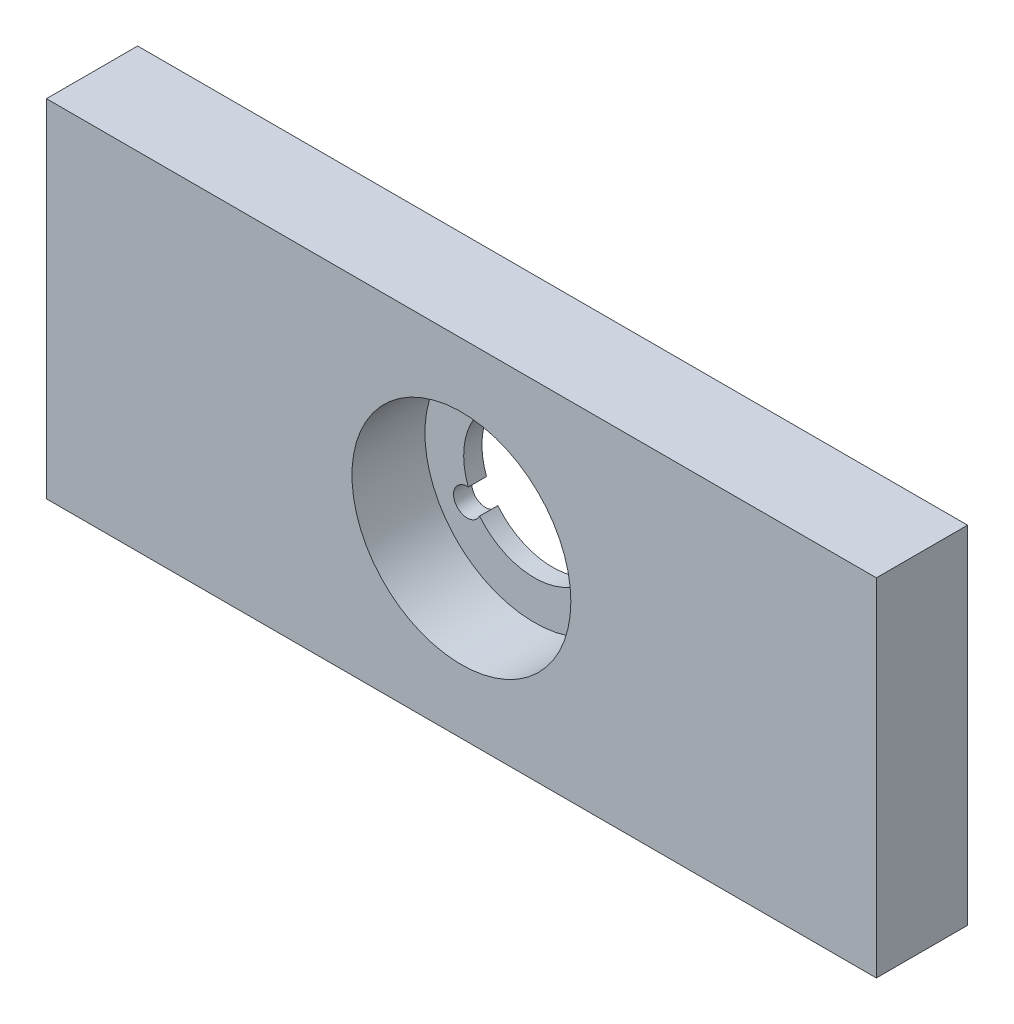
ISO-10303-21;
HEADER;
FILE_DESCRIPTION(('STEP AP214'),'2;1');
FILE_NAME('part.step','',(''),(''),'','','');
FILE_SCHEMA(('AUTOMOTIVE_DESIGN { 1 0 10303 214 1 1 1 1 }'));
ENDSEC;
DATA;
#1=APPLICATION_CONTEXT('core data for automotive mechanical design processes');
#2=APPLICATION_PROTOCOL_DEFINITION('international standard','automotive_design',2000,#1);
#3=PRODUCT_CONTEXT('',#1,'mechanical');
#4=PRODUCT('Part','Part','',(#3));
#5=PRODUCT_RELATED_PRODUCT_CATEGORY('part','',(#4));
#6=PRODUCT_DEFINITION_FORMATION('','',#4);
#7=PRODUCT_DEFINITION_CONTEXT('part definition',#1,'design');
#8=PRODUCT_DEFINITION('design','',#6,#7);
#9=PRODUCT_DEFINITION_SHAPE('','',#8);
#10=(LENGTH_UNIT() NAMED_UNIT(*) SI_UNIT(.MILLI.,.METRE.));
#11=(NAMED_UNIT(*) PLANE_ANGLE_UNIT() SI_UNIT($,.RADIAN.));
#12=(NAMED_UNIT(*) SI_UNIT($,.STERADIAN.) SOLID_ANGLE_UNIT());
#13=UNCERTAINTY_MEASURE_WITH_UNIT(LENGTH_MEASURE(1.E-05),#10,'distance_accuracy_value','');
#14=(GEOMETRIC_REPRESENTATION_CONTEXT(3) GLOBAL_UNCERTAINTY_ASSIGNED_CONTEXT((#13)) GLOBAL_UNIT_ASSIGNED_CONTEXT((#10,
#11,#12)) REPRESENTATION_CONTEXT('',''));
#15=CARTESIAN_POINT('',(0.,0.,0.));
#16=DIRECTION('',(0.,0.,1.));
#17=DIRECTION('',(1.,0.,0.));
#18=AXIS2_PLACEMENT_3D('',#15,#16,#17);
#19=CARTESIAN_POINT('',(45.5,-19.,10.));
#20=DIRECTION('',(0.,0.,-1.));
#21=DIRECTION('',(-1.,0.,0.));
#22=AXIS2_PLACEMENT_3D('',#19,#20,#21);
#23=CYLINDRICAL_SURFACE('',#22,7.75);
#24=DIRECTION('',(0.,0.,-1.));
#25=VECTOR('',#24,1.);
#26=CARTESIAN_POINT('',(52.7439441639615,-21.7545912490619,10.));
#27=LINE('',#26,#25);
#28=CARTESIAN_POINT('',(52.7439441639615,-21.7545912490619,2.));
#29=VERTEX_POINT('',#28);
#30=CARTESIAN_POINT('',(52.7439441639615,-21.7545912490619,0.));
#31=VERTEX_POINT('',#30);
#32=EDGE_CURVE('E52',#29,#31,#27,.T.);
#33=ORIENTED_EDGE('',*,*,#32,.F.);
#34=CARTESIAN_POINT('',(45.5,-19.,2.));
#35=DIRECTION('',(0.,0.,1.));
#36=DIRECTION('',(1.,0.,0.));
#37=AXIS2_PLACEMENT_3D('',#34,#35,#36);
#38=CIRCLE('',#37,7.75);
#39=CARTESIAN_POINT('',(46.7364260832507,-11.3492647058823,2.));
#40=VERTEX_POINT('',#39);
#41=EDGE_CURVE('E46',#29,#40,#38,.T.);
#42=ORIENTED_EDGE('',*,*,#41,.T.);
#43=DIRECTION('',(0.,0.,-1.));
#44=VECTOR('',#43,1.);
#45=CARTESIAN_POINT('',(46.7364260832507,-11.3492647058823,10.));
#46=LINE('',#45,#44);
#47=CARTESIAN_POINT('',(46.7364260832507,-11.3492647058823,0.));
#48=VERTEX_POINT('',#47);
#49=EDGE_CURVE('E133',#40,#48,#46,.T.);
#50=ORIENTED_EDGE('',*,*,#49,.T.);
#51=CARTESIAN_POINT('',(45.5,-19.,0.));
#52=DIRECTION('',(0.,0.,1.));
#53=DIRECTION('',(1.,0.,0.));
#54=AXIS2_PLACEMENT_3D('',#51,#52,#53);
#55=CIRCLE('',#54,7.75);
#56=EDGE_CURVE('E321',#31,#48,#55,.T.);
#57=ORIENTED_EDGE('',*,*,#56,.F.);
#58=EDGE_LOOP('',(#33,#42,#50,#57));
#59=FACE_BOUND('',#58,.T.);
#60=ADVANCED_FACE('F31',(#59),#23,.F.);
#61=CARTESIAN_POINT('',(45.5,-10.5,10.));
#62=DIRECTION('',(0.,0.,-1.));
#63=DIRECTION('',(-1.,0.,0.));
#64=AXIS2_PLACEMENT_3D('',#61,#62,#63);
#65=CYLINDRICAL_SURFACE('',#64,1.5);
#66=ORIENTED_EDGE('',*,*,#49,.F.);
#67=CARTESIAN_POINT('',(45.5,-10.5,2.));
#68=DIRECTION('',(0.,0.,1.));
#69=DIRECTION('',(1.,0.,0.));
#70=AXIS2_PLACEMENT_3D('',#67,#68,#69);
#71=CIRCLE('',#70,1.5);
#72=CARTESIAN_POINT('',(44.2635739167493,-11.3492647058823,2.));
#73=VERTEX_POINT('',#72);
#74=EDGE_CURVE('E317',#40,#73,#71,.T.);
#75=ORIENTED_EDGE('',*,*,#74,.T.);
#76=DIRECTION('',(0.,0.,-1.));
#77=VECTOR('',#76,1.);
#78=CARTESIAN_POINT('',(44.2635739167493,-11.3492647058823,10.));
#79=LINE('',#78,#77);
#80=CARTESIAN_POINT('',(44.2635739167493,-11.3492647058823,0.));
#81=VERTEX_POINT('',#80);
#82=EDGE_CURVE('E131',#73,#81,#79,.T.);
#83=ORIENTED_EDGE('',*,*,#82,.T.);
#84=CARTESIAN_POINT('',(45.5,-10.5,0.));
#85=DIRECTION('',(0.,0.,1.));
#86=DIRECTION('',(1.,0.,0.));
#87=AXIS2_PLACEMENT_3D('',#84,#85,#86);
#88=CIRCLE('',#87,1.5);
#89=EDGE_CURVE('E324',#48,#81,#88,.T.);
#90=ORIENTED_EDGE('',*,*,#89,.F.);
#91=EDGE_LOOP('',(#66,#75,#83,#90));
#92=FACE_BOUND('',#91,.T.);
#93=ADVANCED_FACE('F196',(#92),#65,.F.);
#94=CARTESIAN_POINT('',(45.5,-19.,10.));
#95=DIRECTION('',(0.,0.,-1.));
#96=DIRECTION('',(-1.,0.,0.));
#97=AXIS2_PLACEMENT_3D('',#94,#95,#96);
#98=CYLINDRICAL_SURFACE('',#97,7.75);
#99=ORIENTED_EDGE('',*,*,#82,.F.);
#100=CARTESIAN_POINT('',(45.5,-19.,2.));
#101=DIRECTION('',(0.,0.,1.));
#102=DIRECTION('',(1.,0.,0.));
#103=AXIS2_PLACEMENT_3D('',#100,#101,#102);
#104=CIRCLE('',#103,7.75);
#105=CARTESIAN_POINT('',(38.2560558360386,-21.7545912490621,2.));
#106=VERTEX_POINT('',#105);
#107=EDGE_CURVE('E314',#73,#106,#104,.T.);
#108=ORIENTED_EDGE('',*,*,#107,.T.);
#109=DIRECTION('',(0.,0.,-1.));
#110=VECTOR('',#109,1.);
#111=CARTESIAN_POINT('',(38.2560558360386,-21.7545912490621,10.));
#112=LINE('',#111,#110);
#113=CARTESIAN_POINT('',(38.2560558360386,-21.7545912490621,0.));
#114=VERTEX_POINT('',#113);
#115=EDGE_CURVE('E125',#106,#114,#112,.T.);
#116=ORIENTED_EDGE('',*,*,#115,.T.);
#117=CARTESIAN_POINT('',(45.5,-19.,0.));
#118=DIRECTION('',(0.,0.,1.));
#119=DIRECTION('',(1.,0.,0.));
#120=AXIS2_PLACEMENT_3D('',#117,#118,#119);
#121=CIRCLE('',#120,7.75);
#122=EDGE_CURVE('E327',#81,#114,#121,.T.);
#123=ORIENTED_EDGE('',*,*,#122,.F.);
#124=EDGE_LOOP('',(#99,#108,#116,#123));
#125=FACE_BOUND('',#124,.T.);
#126=ADVANCED_FACE('F201',(#125),#98,.F.);
#127=CARTESIAN_POINT('',(38.1387840678324,-23.25,10.));
#128=DIRECTION('',(0.,0.,-1.));
#129=DIRECTION('',(-1.,0.,0.));
#130=AXIS2_PLACEMENT_3D('',#127,#128,#129);
#131=CYLINDRICAL_SURFACE('',#130,1.5);
#132=ORIENTED_EDGE('',*,*,#115,.F.);
#133=CARTESIAN_POINT('',(38.1387840678324,-23.25,2.));
#134=DIRECTION('',(0.,0.,1.));
#135=DIRECTION('',(1.,0.,0.));
#136=AXIS2_PLACEMENT_3D('',#133,#134,#135);
#137=CIRCLE('',#136,1.5);
#138=CARTESIAN_POINT('',(39.4924819192893,-23.8961440450557,2.));
#139=VERTEX_POINT('',#138);
#140=EDGE_CURVE('E117',#106,#139,#137,.T.);
#141=ORIENTED_EDGE('',*,*,#140,.T.);
#142=DIRECTION('',(0.,0.,-1.));
#143=VECTOR('',#142,1.);
#144=CARTESIAN_POINT('',(39.4924819192893,-23.8961440450557,10.));
#145=LINE('',#144,#143);
#146=CARTESIAN_POINT('',(39.4924819192893,-23.8961440450557,0.));
#147=VERTEX_POINT('',#146);
#148=EDGE_CURVE('E116',#139,#147,#145,.T.);
#149=ORIENTED_EDGE('',*,*,#148,.T.);
#150=CARTESIAN_POINT('',(38.1387840678324,-23.25,0.));
#151=DIRECTION('',(0.,0.,1.));
#152=DIRECTION('',(1.,0.,0.));
#153=AXIS2_PLACEMENT_3D('',#150,#151,#152);
#154=CIRCLE('',#153,1.5);
#155=EDGE_CURVE('E330',#114,#147,#154,.T.);
#156=ORIENTED_EDGE('',*,*,#155,.F.);
#157=EDGE_LOOP('',(#132,#141,#149,#156));
#158=FACE_BOUND('',#157,.T.);
#159=ADVANCED_FACE('F207',(#158),#131,.F.);
#160=CARTESIAN_POINT('',(45.5,-19.,10.));
#161=DIRECTION('',(0.,0.,-1.));
#162=DIRECTION('',(-1.,0.,0.));
#163=AXIS2_PLACEMENT_3D('',#160,#161,#162);
#164=CYLINDRICAL_SURFACE('',#163,7.75);
#165=ORIENTED_EDGE('',*,*,#148,.F.);
#166=CARTESIAN_POINT('',(45.5,-19.,2.));
#167=DIRECTION('',(0.,0.,1.));
#168=DIRECTION('',(1.,0.,0.));
#169=AXIS2_PLACEMENT_3D('',#166,#167,#168);
#170=CIRCLE('',#169,7.75);
#171=CARTESIAN_POINT('',(51.5075180807109,-23.8961440450554,2.));
#172=VERTEX_POINT('',#171);
#173=EDGE_CURVE('E108',#139,#172,#170,.T.);
#174=ORIENTED_EDGE('',*,*,#173,.T.);
#175=DIRECTION('',(0.,0.,-1.));
#176=VECTOR('',#175,1.);
#177=CARTESIAN_POINT('',(51.5075180807109,-23.8961440450554,10.));
#178=LINE('',#177,#176);
#179=CARTESIAN_POINT('',(51.5075180807109,-23.8961440450554,0.));
#180=VERTEX_POINT('',#179);
#181=EDGE_CURVE('E115',#172,#180,#178,.T.);
#182=ORIENTED_EDGE('',*,*,#181,.T.);
#183=CARTESIAN_POINT('',(45.5,-19.,0.));
#184=DIRECTION('',(0.,0.,1.));
#185=DIRECTION('',(1.,0.,0.));
#186=AXIS2_PLACEMENT_3D('',#183,#184,#185);
#187=CIRCLE('',#186,7.75);
#188=EDGE_CURVE('E333',#147,#180,#187,.T.);
#189=ORIENTED_EDGE('',*,*,#188,.F.);
#190=EDGE_LOOP('',(#165,#174,#182,#189));
#191=FACE_BOUND('',#190,.T.);
#192=ADVANCED_FACE('F113',(#191),#164,.F.);
#193=CARTESIAN_POINT('',(52.8612159321678,-23.2499999999999,10.));
#194=DIRECTION('',(0.,0.,-1.));
#195=DIRECTION('',(-1.,0.,0.));
#196=AXIS2_PLACEMENT_3D('',#193,#194,#195);
#197=CYLINDRICAL_SURFACE('',#196,1.5);
#198=ORIENTED_EDGE('',*,*,#181,.F.);
#199=CARTESIAN_POINT('',(52.8612159321678,-23.2499999999999,2.));
#200=DIRECTION('',(0.,0.,1.));
#201=DIRECTION('',(1.,0.,0.));
#202=AXIS2_PLACEMENT_3D('',#199,#200,#201);
#203=CIRCLE('',#202,1.5);
#204=EDGE_CURVE('E11',#172,#29,#203,.T.);
#205=ORIENTED_EDGE('',*,*,#204,.T.);
#206=ORIENTED_EDGE('',*,*,#32,.T.);
#207=CARTESIAN_POINT('',(52.8612159321678,-23.2499999999999,0.));
#208=DIRECTION('',(0.,0.,1.));
#209=DIRECTION('',(1.,0.,0.));
#210=AXIS2_PLACEMENT_3D('',#207,#208,#209);
#211=CIRCLE('',#210,1.5);
#212=EDGE_CURVE('E122',#180,#31,#211,.T.);
#213=ORIENTED_EDGE('',*,*,#212,.F.);
#214=EDGE_LOOP('',(#198,#205,#206,#213));
#215=FACE_BOUND('',#214,.T.);
#216=ADVANCED_FACE('F120',(#215),#197,.F.);
#217=CARTESIAN_POINT('',(0.,0.,10.));
#218=DIRECTION('',(0.,0.,-1.));
#219=DIRECTION('',(-1.,0.,0.));
#220=AXIS2_PLACEMENT_3D('',#217,#218,#219);
#221=PLANE('',#220);
#222=CARTESIAN_POINT('',(45.5,-19.,10.));
#223=DIRECTION('',(0.,0.,1.));
#224=DIRECTION('',(1.,0.,0.));
#225=AXIS2_PLACEMENT_3D('',#222,#223,#224);
#226=CIRCLE('',#225,12.);
#227=CARTESIAN_POINT('',(57.5,-19.,10.));
#228=VERTEX_POINT('',#227);
#229=EDGE_CURVE('E309',#228,#228,#226,.T.);
#230=ORIENTED_EDGE('',*,*,#229,.F.);
#231=EDGE_LOOP('',(#230));
#232=FACE_BOUND('',#231,.T.);
#233=DIRECTION('',(0.,-1.,0.));
#234=VECTOR('',#233,1.);
#235=CARTESIAN_POINT('',(0.,-38.,10.));
#236=LINE('',#235,#234);
#237=CARTESIAN_POINT('',(0.,0.,10.));
#238=VERTEX_POINT('',#237);
#239=CARTESIAN_POINT('',(0.,-38.,10.));
#240=VERTEX_POINT('',#239);
#241=EDGE_CURVE('E136',#238,#240,#236,.T.);
#242=ORIENTED_EDGE('',*,*,#241,.T.);
#243=DIRECTION('',(1.,0.,0.));
#244=VECTOR('',#243,1.);
#245=CARTESIAN_POINT('',(91.,-38.,10.));
#246=LINE('',#245,#244);
#247=CARTESIAN_POINT('',(91.,-38.,10.));
#248=VERTEX_POINT('',#247);
#249=EDGE_CURVE('E139',#240,#248,#246,.T.);
#250=ORIENTED_EDGE('',*,*,#249,.T.);
#251=DIRECTION('',(0.,1.,0.));
#252=VECTOR('',#251,1.);
#253=CARTESIAN_POINT('',(91.,0.,10.));
#254=LINE('',#253,#252);
#255=CARTESIAN_POINT('',(91.,0.,10.));
#256=VERTEX_POINT('',#255);
#257=EDGE_CURVE('E142',#248,#256,#254,.T.);
#258=ORIENTED_EDGE('',*,*,#257,.T.);
#259=DIRECTION('',(-1.,0.,0.));
#260=VECTOR('',#259,1.);
#261=CARTESIAN_POINT('',(0.,0.,10.));
#262=LINE('',#261,#260);
#263=EDGE_CURVE('E144',#256,#238,#262,.T.);
#264=ORIENTED_EDGE('',*,*,#263,.T.);
#265=EDGE_LOOP('',(#242,#250,#258,#264));
#266=FACE_BOUND('',#265,.T.);
#267=ADVANCED_FACE('F183',(#232,#266),#221,.F.);
#268=CARTESIAN_POINT('',(0.,0.,0.));
#269=DIRECTION('',(0.,0.,-1.));
#270=DIRECTION('',(-1.,0.,0.));
#271=AXIS2_PLACEMENT_3D('',#268,#269,#270);
#272=PLANE('',#271);
#273=DIRECTION('',(0.,-1.,0.));
#274=VECTOR('',#273,1.);
#275=CARTESIAN_POINT('',(0.,-38.,0.));
#276=LINE('',#275,#274);
#277=CARTESIAN_POINT('',(0.,0.,0.));
#278=VERTEX_POINT('',#277);
#279=CARTESIAN_POINT('',(0.,-38.,0.));
#280=VERTEX_POINT('',#279);
#281=EDGE_CURVE('E135',#278,#280,#276,.T.);
#282=ORIENTED_EDGE('',*,*,#281,.F.);
#283=DIRECTION('',(-1.,0.,0.));
#284=VECTOR('',#283,1.);
#285=CARTESIAN_POINT('',(0.,0.,0.));
#286=LINE('',#285,#284);
#287=CARTESIAN_POINT('',(91.,0.,0.));
#288=VERTEX_POINT('',#287);
#289=EDGE_CURVE('E140',#288,#278,#286,.T.);
#290=ORIENTED_EDGE('',*,*,#289,.F.);
#291=DIRECTION('',(0.,1.,0.));
#292=VECTOR('',#291,1.);
#293=CARTESIAN_POINT('',(91.,0.,0.));
#294=LINE('',#293,#292);
#295=CARTESIAN_POINT('',(91.,-38.,0.));
#296=VERTEX_POINT('',#295);
#297=EDGE_CURVE('E151',#296,#288,#294,.T.);
#298=ORIENTED_EDGE('',*,*,#297,.F.);
#299=DIRECTION('',(1.,0.,0.));
#300=VECTOR('',#299,1.);
#301=CARTESIAN_POINT('',(91.,-38.,0.));
#302=LINE('',#301,#300);
#303=EDGE_CURVE('E149',#280,#296,#302,.T.);
#304=ORIENTED_EDGE('',*,*,#303,.F.);
#305=EDGE_LOOP('',(#282,#290,#298,#304));
#306=FACE_BOUND('',#305,.T.);
#307=ORIENTED_EDGE('',*,*,#212,.T.);
#308=ORIENTED_EDGE('',*,*,#56,.T.);
#309=ORIENTED_EDGE('',*,*,#89,.T.);
#310=ORIENTED_EDGE('',*,*,#122,.T.);
#311=ORIENTED_EDGE('',*,*,#155,.T.);
#312=ORIENTED_EDGE('',*,*,#188,.T.);
#313=EDGE_LOOP('',(#307,#308,#309,#310,#311,#312));
#314=FACE_BOUND('',#313,.T.);
#315=ADVANCED_FACE('F172',(#306,#314),#272,.T.);
#316=CARTESIAN_POINT('',(0.,-38.,10.));
#317=DIRECTION('',(1.,0.,0.));
#318=DIRECTION('',(0.,0.,-1.));
#319=AXIS2_PLACEMENT_3D('',#316,#317,#318);
#320=PLANE('',#319);
#321=ORIENTED_EDGE('',*,*,#281,.T.);
#322=DIRECTION('',(0.,0.,-1.));
#323=VECTOR('',#322,1.);
#324=CARTESIAN_POINT('',(0.,-38.,10.));
#325=LINE('',#324,#323);
#326=EDGE_CURVE('E39',#240,#280,#325,.T.);
#327=ORIENTED_EDGE('',*,*,#326,.F.);
#328=ORIENTED_EDGE('',*,*,#241,.F.);
#329=DIRECTION('',(0.,0.,-1.));
#330=VECTOR('',#329,1.);
#331=CARTESIAN_POINT('',(0.,0.,10.));
#332=LINE('',#331,#330);
#333=EDGE_CURVE('E146',#238,#278,#332,.T.);
#334=ORIENTED_EDGE('',*,*,#333,.T.);
#335=EDGE_LOOP('',(#321,#327,#328,#334));
#336=FACE_BOUND('',#335,.T.);
#337=ADVANCED_FACE('F33',(#336),#320,.F.);
#338=CARTESIAN_POINT('',(91.,-38.,10.));
#339=DIRECTION('',(0.,1.,0.));
#340=DIRECTION('',(-1.,0.,0.));
#341=AXIS2_PLACEMENT_3D('',#338,#339,#340);
#342=PLANE('',#341);
#343=ORIENTED_EDGE('',*,*,#303,.T.);
#344=DIRECTION('',(0.,0.,-1.));
#345=VECTOR('',#344,1.);
#346=CARTESIAN_POINT('',(91.,-38.,10.));
#347=LINE('',#346,#345);
#348=EDGE_CURVE('E159',#248,#296,#347,.T.);
#349=ORIENTED_EDGE('',*,*,#348,.F.);
#350=ORIENTED_EDGE('',*,*,#249,.F.);
#351=ORIENTED_EDGE('',*,*,#326,.T.);
#352=EDGE_LOOP('',(#343,#349,#350,#351));
#353=FACE_BOUND('',#352,.T.);
#354=ADVANCED_FACE('F164',(#353),#342,.F.);
#355=CARTESIAN_POINT('',(91.,0.,10.));
#356=DIRECTION('',(-1.,0.,0.));
#357=DIRECTION('',(0.,0.,1.));
#358=AXIS2_PLACEMENT_3D('',#355,#356,#357);
#359=PLANE('',#358);
#360=ORIENTED_EDGE('',*,*,#297,.T.);
#361=DIRECTION('',(0.,0.,-1.));
#362=VECTOR('',#361,1.);
#363=CARTESIAN_POINT('',(91.,0.,10.));
#364=LINE('',#363,#362);
#365=EDGE_CURVE('E156',#256,#288,#364,.T.);
#366=ORIENTED_EDGE('',*,*,#365,.F.);
#367=ORIENTED_EDGE('',*,*,#257,.F.);
#368=ORIENTED_EDGE('',*,*,#348,.T.);
#369=EDGE_LOOP('',(#360,#366,#367,#368));
#370=FACE_BOUND('',#369,.T.);
#371=ADVANCED_FACE('F177',(#370),#359,.F.);
#372=CARTESIAN_POINT('',(0.,0.,10.));
#373=DIRECTION('',(0.,-1.,0.));
#374=DIRECTION('',(0.,0.,-1.));
#375=AXIS2_PLACEMENT_3D('',#372,#373,#374);
#376=PLANE('',#375);
#377=ORIENTED_EDGE('',*,*,#289,.T.);
#378=ORIENTED_EDGE('',*,*,#333,.F.);
#379=ORIENTED_EDGE('',*,*,#263,.F.);
#380=ORIENTED_EDGE('',*,*,#365,.T.);
#381=EDGE_LOOP('',(#377,#378,#379,#380));
#382=FACE_BOUND('',#381,.T.);
#383=ADVANCED_FACE('F181',(#382),#376,.F.);
#384=CARTESIAN_POINT('',(45.5,-19.,2.));
#385=DIRECTION('',(0.,0.,1.));
#386=DIRECTION('',(1.,0.,0.));
#387=AXIS2_PLACEMENT_3D('',#384,#385,#386);
#388=CYLINDRICAL_SURFACE('',#387,12.);
#389=CARTESIAN_POINT('',(45.5,-19.,2.));
#390=DIRECTION('',(0.,0.,1.));
#391=DIRECTION('',(1.,0.,0.));
#392=AXIS2_PLACEMENT_3D('',#389,#390,#391);
#393=CIRCLE('',#392,12.);
#394=CARTESIAN_POINT('',(57.5,-19.,2.));
#395=VERTEX_POINT('',#394);
#396=EDGE_CURVE('E118',#395,#395,#393,.T.);
#397=ORIENTED_EDGE('',*,*,#396,.F.);
#398=EDGE_LOOP('',(#397));
#399=FACE_BOUND('',#398,.T.);
#400=ORIENTED_EDGE('',*,*,#229,.T.);
#401=EDGE_LOOP('',(#400));
#402=FACE_BOUND('',#401,.T.);
#403=ADVANCED_FACE('F214',(#399,#402),#388,.F.);
#404=CARTESIAN_POINT('',(45.5,-19.,2.));
#405=DIRECTION('',(0.,0.,1.));
#406=DIRECTION('',(1.,0.,0.));
#407=AXIS2_PLACEMENT_3D('',#404,#405,#406);
#408=PLANE('',#407);
#409=ORIENTED_EDGE('',*,*,#204,.F.);
#410=ORIENTED_EDGE('',*,*,#173,.F.);
#411=ORIENTED_EDGE('',*,*,#140,.F.);
#412=ORIENTED_EDGE('',*,*,#107,.F.);
#413=ORIENTED_EDGE('',*,*,#74,.F.);
#414=ORIENTED_EDGE('',*,*,#41,.F.);
#415=EDGE_LOOP('',(#409,#410,#411,#412,#413,#414));
#416=FACE_BOUND('',#415,.T.);
#417=ORIENTED_EDGE('',*,*,#396,.T.);
#418=EDGE_LOOP('',(#417));
#419=FACE_BOUND('',#418,.T.);
#420=ADVANCED_FACE('F106',(#416,#419),#408,.T.);
#421=CLOSED_SHELL('',(#60,#93,#126,#159,#192,#216,#267,#315,#337,#354,#371,#383,#403,#420));
#422=MANIFOLD_SOLID_BREP('B2',#421);
#423=ADVANCED_BREP_SHAPE_REPRESENTATION('',(#18,#422),#14);
#424=SHAPE_DEFINITION_REPRESENTATION(#9,#423);
ENDSEC;
END-ISO-10303-21;
